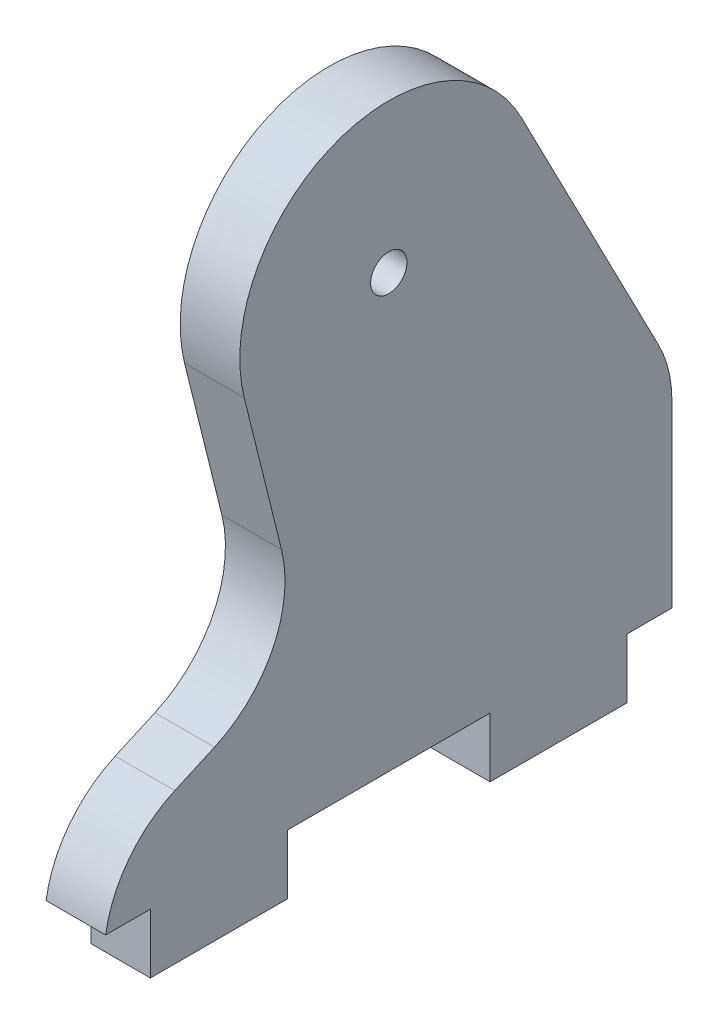
ISO-10303-21;
HEADER;
FILE_DESCRIPTION(('STEP AP214'),'2;1');
FILE_NAME('part.step','',(''),(''),'','','');
FILE_SCHEMA(('AUTOMOTIVE_DESIGN { 1 0 10303 214 1 1 1 1 }'));
ENDSEC;
DATA;
#1=APPLICATION_CONTEXT('core data for automotive mechanical design processes');
#2=APPLICATION_PROTOCOL_DEFINITION('international standard','automotive_design',2000,#1);
#3=PRODUCT_CONTEXT('',#1,'mechanical');
#4=PRODUCT('Part','Part','',(#3));
#5=PRODUCT_RELATED_PRODUCT_CATEGORY('part','',(#4));
#6=PRODUCT_DEFINITION_FORMATION('','',#4);
#7=PRODUCT_DEFINITION_CONTEXT('part definition',#1,'design');
#8=PRODUCT_DEFINITION('design','',#6,#7);
#9=PRODUCT_DEFINITION_SHAPE('','',#8);
#10=(LENGTH_UNIT() NAMED_UNIT(*) SI_UNIT(.MILLI.,.METRE.));
#11=(NAMED_UNIT(*) PLANE_ANGLE_UNIT() SI_UNIT($,.RADIAN.));
#12=(NAMED_UNIT(*) SI_UNIT($,.STERADIAN.) SOLID_ANGLE_UNIT());
#13=UNCERTAINTY_MEASURE_WITH_UNIT(LENGTH_MEASURE(1.E-05),#10,'distance_accuracy_value','');
#14=(GEOMETRIC_REPRESENTATION_CONTEXT(3) GLOBAL_UNCERTAINTY_ASSIGNED_CONTEXT((#13)) GLOBAL_UNIT_ASSIGNED_CONTEXT((#10,
#11,#12)) REPRESENTATION_CONTEXT('',''));
#15=CARTESIAN_POINT('',(0.,0.,0.));
#16=DIRECTION('',(0.,0.,1.));
#17=DIRECTION('',(1.,0.,0.));
#18=AXIS2_PLACEMENT_3D('',#15,#16,#17);
#19=CARTESIAN_POINT('',(2.5,0.,0.));
#20=DIRECTION('',(1.,0.,0.));
#21=DIRECTION('',(0.,0.,-1.));
#22=AXIS2_PLACEMENT_3D('',#19,#20,#21);
#23=PLANE('',#22);
#24=CARTESIAN_POINT('',(2.5,36.23668181,0.));
#25=DIRECTION('',(-1.,0.,0.));
#26=DIRECTION('',(0.,0.,1.));
#27=AXIS2_PLACEMENT_3D('',#24,#25,#26);
#28=CIRCLE('',#27,1.525);
#29=CARTESIAN_POINT('',(2.5,36.23668181,1.525));
#30=VERTEX_POINT('',#29);
#31=EDGE_CURVE('E109',#30,#30,#28,.T.);
#32=ORIENTED_EDGE('',*,*,#31,.T.);
#33=EDGE_LOOP('',(#32));
#34=FACE_BOUND('',#33,.T.);
#35=DIRECTION('',(0.,1.,0.));
#36=VECTOR('',#35,1.);
#37=CARTESIAN_POINT('',(2.5,0.,-20.));
#38=LINE('',#37,#36);
#39=CARTESIAN_POINT('',(2.5,0.,-20.));
#40=VERTEX_POINT('',#39);
#41=CARTESIAN_POINT('',(2.5,-5.,-20.));
#42=VERTEX_POINT('',#41);
#43=EDGE_CURVE('E124',#40,#42,#38,.F.);
#44=ORIENTED_EDGE('',*,*,#43,.F.);
#45=DIRECTION('',(0.,0.,-1.));
#46=VECTOR('',#45,1.);
#47=CARTESIAN_POINT('',(2.5,0.,0.));
#48=LINE('',#47,#46);
#49=CARTESIAN_POINT('',(2.5,0.,-23.75));
#50=VERTEX_POINT('',#49);
#51=EDGE_CURVE('E117',#50,#40,#48,.F.);
#52=ORIENTED_EDGE('',*,*,#51,.F.);
#53=DIRECTION('',(0.,1.,0.));
#54=VECTOR('',#53,1.);
#55=CARTESIAN_POINT('',(2.5,0.,-23.75));
#56=LINE('',#55,#54);
#57=CARTESIAN_POINT('',(2.5,15.0693744428278,-23.75));
#58=VERTEX_POINT('',#57);
#59=EDGE_CURVE('E110',#50,#58,#56,.T.);
#60=ORIENTED_EDGE('',*,*,#59,.T.);
#61=CARTESIAN_POINT('',(2.5,15.0693744428278,-13.75));
#62=DIRECTION('',(-1.,0.,0.));
#63=DIRECTION('',(0.,0.,1.));
#64=AXIS2_PLACEMENT_3D('',#61,#62,#63);
#65=CIRCLE('',#64,10.);
#66=CARTESIAN_POINT('',(2.5,19.6594468083574,-22.6343252799074));
#67=VERTEX_POINT('',#66);
#68=EDGE_CURVE('E113',#67,#58,#65,.T.);
#69=ORIENTED_EDGE('',*,*,#68,.F.);
#70=DIRECTION('',(0.,-0.888432527990742,-0.459007236552955));
#71=VECTOR('',#70,1.);
#72=CARTESIAN_POINT('',(2.5,13.3722115451383,-25.8826152657042));
#73=LINE('',#72,#71);
#74=CARTESIAN_POINT('',(2.5,41.9742722669119,-11.1054065998843));
#75=VERTEX_POINT('',#74);
#76=EDGE_CURVE('E89',#67,#75,#73,.F.);
#77=ORIENTED_EDGE('',*,*,#76,.T.);
#78=CARTESIAN_POINT('',(2.5,36.23668181,0.));
#79=DIRECTION('',(-1.,0.,0.));
#80=DIRECTION('',(0.,0.,1.));
#81=AXIS2_PLACEMENT_3D('',#78,#79,#80);
#82=CIRCLE('',#81,12.5);
#83=CARTESIAN_POINT('',(2.5,33.2203384044635,12.130608907218));
#84=VERTEX_POINT('',#83);
#85=EDGE_CURVE('E19',#84,#75,#82,.T.);
#86=ORIENTED_EDGE('',*,*,#85,.F.);
#87=DIRECTION('',(0.,0.970448712577439,0.241307472442921));
#88=VECTOR('',#87,1.);
#89=CARTESIAN_POINT('',(2.5,-0.90630692505895,3.64482864836073));
#90=LINE('',#89,#88);
#91=CARTESIAN_POINT('',(2.5,20.6225242322865,8.99809231278635));
#92=VERTEX_POINT('',#91);
#93=EDGE_CURVE('E87',#84,#92,#90,.F.);
#94=ORIENTED_EDGE('',*,*,#93,.T.);
#95=CARTESIAN_POINT('',(2.5,18.2094495078573,18.7025794385607));
#96=DIRECTION('',(1.,0.,0.));
#97=DIRECTION('',(0.,0.,-1.));
#98=AXIS2_PLACEMENT_3D('',#95,#96,#97);
#99=CIRCLE('',#98,10.);
#100=CARTESIAN_POINT('',(2.5,9.0798918665335,14.6219940303446));
#101=VERTEX_POINT('',#100);
#102=EDGE_CURVE('E193',#92,#101,#99,.F.);
#103=ORIENTED_EDGE('',*,*,#102,.T.);
#104=DIRECTION('',(0.,0.408058540821615,-0.912955764132378));
#105=VECTOR('',#104,1.);
#106=CARTESIAN_POINT('',(2.5,13.015251813793,5.8173515872475));
#107=LINE('',#106,#105);
#108=CARTESIAN_POINT('',(2.5,7.59266349620767,17.9493933552952));
#109=VERTEX_POINT('',#108);
#110=EDGE_CURVE('E171',#101,#109,#107,.F.);
#111=ORIENTED_EDGE('',*,*,#110,.T.);
#112=CARTESIAN_POINT('',(2.5,-1.53689414511612,13.8688079470791));
#113=DIRECTION('',(-1.,0.,0.));
#114=DIRECTION('',(0.,0.,1.));
#115=AXIS2_PLACEMENT_3D('',#112,#113,#114);
#116=CIRCLE('',#115,10.);
#117=CARTESIAN_POINT('',(2.5,0.,23.75));
#118=VERTEX_POINT('',#117);
#119=EDGE_CURVE('E173',#118,#109,#116,.T.);
#120=ORIENTED_EDGE('',*,*,#119,.F.);
#121=DIRECTION('',(0.,0.,-1.));
#122=VECTOR('',#121,1.);
#123=CARTESIAN_POINT('',(2.5,0.,0.));
#124=LINE('',#123,#122);
#125=CARTESIAN_POINT('',(2.5,0.,20.));
#126=VERTEX_POINT('',#125);
#127=EDGE_CURVE('E165',#126,#118,#124,.F.);
#128=ORIENTED_EDGE('',*,*,#127,.F.);
#129=DIRECTION('',(0.,1.,0.));
#130=VECTOR('',#129,1.);
#131=CARTESIAN_POINT('',(2.5,0.,20.));
#132=LINE('',#131,#130);
#133=CARTESIAN_POINT('',(2.5,-5.,20.));
#134=VERTEX_POINT('',#133);
#135=EDGE_CURVE('E157',#126,#134,#132,.F.);
#136=ORIENTED_EDGE('',*,*,#135,.T.);
#137=DIRECTION('',(0.,0.,-1.));
#138=VECTOR('',#137,1.);
#139=CARTESIAN_POINT('',(2.5,-5.,0.));
#140=LINE('',#139,#138);
#141=CARTESIAN_POINT('',(2.5,-5.,8.5));
#142=VERTEX_POINT('',#141);
#143=EDGE_CURVE('E154',#142,#134,#140,.F.);
#144=ORIENTED_EDGE('',*,*,#143,.F.);
#145=DIRECTION('',(0.,1.,0.));
#146=VECTOR('',#145,1.);
#147=CARTESIAN_POINT('',(2.5,0.,8.5));
#148=LINE('',#147,#146);
#149=CARTESIAN_POINT('',(2.5,0.,8.5));
#150=VERTEX_POINT('',#149);
#151=EDGE_CURVE('E148',#150,#142,#148,.F.);
#152=ORIENTED_EDGE('',*,*,#151,.F.);
#153=DIRECTION('',(0.,0.,-1.));
#154=VECTOR('',#153,1.);
#155=CARTESIAN_POINT('',(2.5,0.,0.));
#156=LINE('',#155,#154);
#157=CARTESIAN_POINT('',(2.5,0.,-8.5));
#158=VERTEX_POINT('',#157);
#159=EDGE_CURVE('E141',#158,#150,#156,.F.);
#160=ORIENTED_EDGE('',*,*,#159,.F.);
#161=DIRECTION('',(0.,1.,0.));
#162=VECTOR('',#161,1.);
#163=CARTESIAN_POINT('',(2.5,0.,-8.5));
#164=LINE('',#163,#162);
#165=CARTESIAN_POINT('',(2.5,-5.,-8.5));
#166=VERTEX_POINT('',#165);
#167=EDGE_CURVE('E135',#158,#166,#164,.F.);
#168=ORIENTED_EDGE('',*,*,#167,.T.);
#169=DIRECTION('',(0.,0.,1.));
#170=VECTOR('',#169,1.);
#171=CARTESIAN_POINT('',(2.5,-5.,0.));
#172=LINE('',#171,#170);
#173=EDGE_CURVE('E127',#166,#42,#172,.F.);
#174=ORIENTED_EDGE('',*,*,#173,.T.);
#175=EDGE_LOOP('',(#44,#52,#60,#69,#77,#86,#94,#103,#111,#120,#128,#136,#144,#152,#160,#168,#174));
#176=FACE_BOUND('',#175,.T.);
#177=ADVANCED_FACE('F16',(#34,#176),#23,.T.);
#178=CARTESIAN_POINT('',(2.5,36.23668181,0.));
#179=DIRECTION('',(-1.,0.,0.));
#180=DIRECTION('',(0.,0.,1.));
#181=AXIS2_PLACEMENT_3D('',#178,#179,#180);
#182=CYLINDRICAL_SURFACE('',#181,12.5);
#183=CARTESIAN_POINT('',(-2.5,36.23668181,0.));
#184=DIRECTION('',(-1.,0.,0.));
#185=DIRECTION('',(0.,0.,1.));
#186=AXIS2_PLACEMENT_3D('',#183,#184,#185);
#187=CIRCLE('',#186,12.5);
#188=CARTESIAN_POINT('',(-2.5,41.9742722669119,-11.1054065998843));
#189=VERTEX_POINT('',#188);
#190=CARTESIAN_POINT('',(-2.5,33.2203384044635,12.130608907218));
#191=VERTEX_POINT('',#190);
#192=EDGE_CURVE('E103',#189,#191,#187,.F.);
#193=ORIENTED_EDGE('',*,*,#192,.T.);
#194=DIRECTION('',(1.,0.,0.));
#195=VECTOR('',#194,1.);
#196=CARTESIAN_POINT('',(2.5,33.2203384044635,12.130608907218));
#197=LINE('',#196,#195);
#198=EDGE_CURVE('E94',#191,#84,#197,.T.);
#199=ORIENTED_EDGE('',*,*,#198,.T.);
#200=ORIENTED_EDGE('',*,*,#85,.T.);
#201=DIRECTION('',(1.,0.,0.));
#202=VECTOR('',#201,1.);
#203=CARTESIAN_POINT('',(2.5,41.9742722669119,-11.1054065998843));
#204=LINE('',#203,#202);
#205=EDGE_CURVE('E278',#75,#189,#204,.F.);
#206=ORIENTED_EDGE('',*,*,#205,.T.);
#207=EDGE_LOOP('',(#193,#199,#200,#206));
#208=FACE_BOUND('',#207,.T.);
#209=ADVANCED_FACE('F102',(#208),#182,.T.);
#210=CARTESIAN_POINT('',(2.5,-0.90630692505895,3.64482864836073));
#211=DIRECTION('',(0.,0.241307472442921,-0.970448712577439));
#212=DIRECTION('',(0.,0.970448712577439,0.241307472442921));
#213=AXIS2_PLACEMENT_3D('',#210,#211,#212);
#214=PLANE('',#213);
#215=DIRECTION('',(1.,0.,0.));
#216=VECTOR('',#215,1.);
#217=CARTESIAN_POINT('',(2.5,20.6225242322865,8.99809231278635));
#218=LINE('',#217,#216);
#219=CARTESIAN_POINT('',(-2.5,20.6225242322865,8.99809231278635));
#220=VERTEX_POINT('',#219);
#221=EDGE_CURVE('E100',#220,#92,#218,.T.);
#222=ORIENTED_EDGE('',*,*,#221,.T.);
#223=ORIENTED_EDGE('',*,*,#93,.F.);
#224=ORIENTED_EDGE('',*,*,#198,.F.);
#225=DIRECTION('',(0.,-0.970448712577439,-0.241307472442921));
#226=VECTOR('',#225,1.);
#227=CARTESIAN_POINT('',(-2.5,33.2203384044635,12.130608907218));
#228=LINE('',#227,#226);
#229=EDGE_CURVE('E187',#191,#220,#228,.T.);
#230=ORIENTED_EDGE('',*,*,#229,.T.);
#231=EDGE_LOOP('',(#222,#223,#224,#230));
#232=FACE_BOUND('',#231,.T.);
#233=ADVANCED_FACE('F97',(#232),#214,.F.);
#234=CARTESIAN_POINT('',(2.5,18.2094495078573,18.7025794385607));
#235=DIRECTION('',(1.,0.,0.));
#236=DIRECTION('',(0.,0.,-1.));
#237=AXIS2_PLACEMENT_3D('',#234,#235,#236);
#238=CYLINDRICAL_SURFACE('',#237,10.);
#239=CARTESIAN_POINT('',(-2.5,18.2094495078573,18.7025794385607));
#240=DIRECTION('',(1.,0.,0.));
#241=DIRECTION('',(0.,0.,-1.));
#242=AXIS2_PLACEMENT_3D('',#239,#240,#241);
#243=CIRCLE('',#242,10.);
#244=CARTESIAN_POINT('',(-2.5,9.0798918665335,14.6219940303446));
#245=VERTEX_POINT('',#244);
#246=EDGE_CURVE('E185',#220,#245,#243,.F.);
#247=ORIENTED_EDGE('',*,*,#246,.T.);
#248=DIRECTION('',(1.,0.,0.));
#249=VECTOR('',#248,1.);
#250=CARTESIAN_POINT('',(2.5,9.0798918665335,14.6219940303446));
#251=LINE('',#250,#249);
#252=EDGE_CURVE('E174',#245,#101,#251,.T.);
#253=ORIENTED_EDGE('',*,*,#252,.T.);
#254=ORIENTED_EDGE('',*,*,#102,.F.);
#255=ORIENTED_EDGE('',*,*,#221,.F.);
#256=EDGE_LOOP('',(#247,#253,#254,#255));
#257=FACE_BOUND('',#256,.T.);
#258=ADVANCED_FACE('F368',(#257),#238,.F.);
#259=CARTESIAN_POINT('',(2.5,13.015251813793,5.8173515872475));
#260=DIRECTION('',(0.,-0.912955764132378,-0.408058540821615));
#261=DIRECTION('',(0.,0.408058540821615,-0.912955764132378));
#262=AXIS2_PLACEMENT_3D('',#259,#260,#261);
#263=PLANE('',#262);
#264=DIRECTION('',(-1.,0.,0.));
#265=VECTOR('',#264,1.);
#266=CARTESIAN_POINT('',(2.5,7.59266349620767,17.9493933552952));
#267=LINE('',#266,#265);
#268=CARTESIAN_POINT('',(-2.5,7.59266349620767,17.9493933552952));
#269=VERTEX_POINT('',#268);
#270=EDGE_CURVE('E168',#109,#269,#267,.T.);
#271=ORIENTED_EDGE('',*,*,#270,.F.);
#272=ORIENTED_EDGE('',*,*,#110,.F.);
#273=ORIENTED_EDGE('',*,*,#252,.F.);
#274=DIRECTION('',(0.,-0.408058540821615,0.912955764132378));
#275=VECTOR('',#274,1.);
#276=CARTESIAN_POINT('',(-2.5,9.0798918665335,14.6219940303446));
#277=LINE('',#276,#275);
#278=EDGE_CURVE('E184',#245,#269,#277,.T.);
#279=ORIENTED_EDGE('',*,*,#278,.T.);
#280=EDGE_LOOP('',(#271,#272,#273,#279));
#281=FACE_BOUND('',#280,.T.);
#282=ADVANCED_FACE('F366',(#281),#263,.F.);
#283=CARTESIAN_POINT('',(2.5,-1.53689414511612,13.8688079470791));
#284=DIRECTION('',(-1.,0.,0.));
#285=DIRECTION('',(0.,0.,1.));
#286=AXIS2_PLACEMENT_3D('',#283,#284,#285);
#287=CYLINDRICAL_SURFACE('',#286,10.);
#288=CARTESIAN_POINT('',(-2.5,-1.53689414511612,13.8688079470791));
#289=DIRECTION('',(-1.,0.,0.));
#290=DIRECTION('',(0.,0.,1.));
#291=AXIS2_PLACEMENT_3D('',#288,#289,#290);
#292=CIRCLE('',#291,10.);
#293=CARTESIAN_POINT('',(-2.5,0.,23.75));
#294=VERTEX_POINT('',#293);
#295=EDGE_CURVE('E180',#269,#294,#292,.F.);
#296=ORIENTED_EDGE('',*,*,#295,.T.);
#297=DIRECTION('',(1.,0.,0.));
#298=VECTOR('',#297,1.);
#299=CARTESIAN_POINT('',(2.5,0.,23.75));
#300=LINE('',#299,#298);
#301=EDGE_CURVE('E167',#118,#294,#300,.F.);
#302=ORIENTED_EDGE('',*,*,#301,.F.);
#303=ORIENTED_EDGE('',*,*,#119,.T.);
#304=ORIENTED_EDGE('',*,*,#270,.T.);
#305=EDGE_LOOP('',(#296,#302,#303,#304));
#306=FACE_BOUND('',#305,.T.);
#307=ADVANCED_FACE('F363',(#306),#287,.T.);
#308=CARTESIAN_POINT('',(2.5,0.,0.));
#309=DIRECTION('',(0.,-1.,0.));
#310=DIRECTION('',(0.,0.,-1.));
#311=AXIS2_PLACEMENT_3D('',#308,#309,#310);
#312=PLANE('',#311);
#313=ORIENTED_EDGE('',*,*,#127,.T.);
#314=ORIENTED_EDGE('',*,*,#301,.T.);
#315=DIRECTION('',(0.,0.,-1.));
#316=VECTOR('',#315,1.);
#317=CARTESIAN_POINT('',(-2.5,0.,0.));
#318=LINE('',#317,#316);
#319=CARTESIAN_POINT('',(-2.5,0.,20.));
#320=VERTEX_POINT('',#319);
#321=EDGE_CURVE('E183',#294,#320,#318,.T.);
#322=ORIENTED_EDGE('',*,*,#321,.T.);
#323=DIRECTION('',(-1.,0.,0.));
#324=VECTOR('',#323,1.);
#325=CARTESIAN_POINT('',(2.5,0.,20.));
#326=LINE('',#325,#324);
#327=EDGE_CURVE('E162',#320,#126,#326,.F.);
#328=ORIENTED_EDGE('',*,*,#327,.T.);
#329=EDGE_LOOP('',(#313,#314,#322,#328));
#330=FACE_BOUND('',#329,.T.);
#331=ADVANCED_FACE('F357',(#330),#312,.T.);
#332=CARTESIAN_POINT('',(2.5,0.,20.));
#333=DIRECTION('',(0.,0.,-1.));
#334=DIRECTION('',(-1.,0.,0.));
#335=AXIS2_PLACEMENT_3D('',#332,#333,#334);
#336=PLANE('',#335);
#337=DIRECTION('',(1.,0.,0.));
#338=VECTOR('',#337,1.);
#339=CARTESIAN_POINT('',(2.5,-5.,20.));
#340=LINE('',#339,#338);
#341=CARTESIAN_POINT('',(-2.5,-5.,20.));
#342=VERTEX_POINT('',#341);
#343=EDGE_CURVE('E151',#134,#342,#340,.F.);
#344=ORIENTED_EDGE('',*,*,#343,.F.);
#345=ORIENTED_EDGE('',*,*,#135,.F.);
#346=ORIENTED_EDGE('',*,*,#327,.F.);
#347=DIRECTION('',(0.,1.,0.));
#348=VECTOR('',#347,1.);
#349=CARTESIAN_POINT('',(-2.5,0.,20.));
#350=LINE('',#349,#348);
#351=EDGE_CURVE('E207',#320,#342,#350,.F.);
#352=ORIENTED_EDGE('',*,*,#351,.T.);
#353=EDGE_LOOP('',(#344,#345,#346,#352));
#354=FACE_BOUND('',#353,.T.);
#355=ADVANCED_FACE('F355',(#354),#336,.F.);
#356=CARTESIAN_POINT('',(2.5,-5.,0.));
#357=DIRECTION('',(0.,-1.,0.));
#358=DIRECTION('',(0.,0.,-1.));
#359=AXIS2_PLACEMENT_3D('',#356,#357,#358);
#360=PLANE('',#359);
#361=ORIENTED_EDGE('',*,*,#143,.T.);
#362=ORIENTED_EDGE('',*,*,#343,.T.);
#363=DIRECTION('',(0.,0.,-1.));
#364=VECTOR('',#363,1.);
#365=CARTESIAN_POINT('',(-2.5,-5.,0.));
#366=LINE('',#365,#364);
#367=CARTESIAN_POINT('',(-2.5,-5.,8.5));
#368=VERTEX_POINT('',#367);
#369=EDGE_CURVE('E210',#342,#368,#366,.T.);
#370=ORIENTED_EDGE('',*,*,#369,.T.);
#371=DIRECTION('',(-1.,0.,0.));
#372=VECTOR('',#371,1.);
#373=CARTESIAN_POINT('',(2.5,-5.,8.5));
#374=LINE('',#373,#372);
#375=EDGE_CURVE('E145',#142,#368,#374,.T.);
#376=ORIENTED_EDGE('',*,*,#375,.F.);
#377=EDGE_LOOP('',(#361,#362,#370,#376));
#378=FACE_BOUND('',#377,.T.);
#379=ADVANCED_FACE('F414',(#378),#360,.T.);
#380=CARTESIAN_POINT('',(2.5,0.,8.5));
#381=DIRECTION('',(0.,0.,-1.));
#382=DIRECTION('',(-1.,0.,0.));
#383=AXIS2_PLACEMENT_3D('',#380,#381,#382);
#384=PLANE('',#383);
#385=ORIENTED_EDGE('',*,*,#151,.T.);
#386=ORIENTED_EDGE('',*,*,#375,.T.);
#387=DIRECTION('',(0.,1.,0.));
#388=VECTOR('',#387,1.);
#389=CARTESIAN_POINT('',(-2.5,0.,8.5));
#390=LINE('',#389,#388);
#391=CARTESIAN_POINT('',(-2.5,0.,8.5));
#392=VERTEX_POINT('',#391);
#393=EDGE_CURVE('E219',#368,#392,#390,.T.);
#394=ORIENTED_EDGE('',*,*,#393,.T.);
#395=DIRECTION('',(1.,0.,0.));
#396=VECTOR('',#395,1.);
#397=CARTESIAN_POINT('',(2.5,0.,8.5));
#398=LINE('',#397,#396);
#399=EDGE_CURVE('E144',#150,#392,#398,.F.);
#400=ORIENTED_EDGE('',*,*,#399,.F.);
#401=EDGE_LOOP('',(#385,#386,#394,#400));
#402=FACE_BOUND('',#401,.T.);
#403=ADVANCED_FACE('F410',(#402),#384,.T.);
#404=CARTESIAN_POINT('',(2.5,0.,0.));
#405=DIRECTION('',(0.,-1.,0.));
#406=DIRECTION('',(0.,0.,-1.));
#407=AXIS2_PLACEMENT_3D('',#404,#405,#406);
#408=PLANE('',#407);
#409=ORIENTED_EDGE('',*,*,#159,.T.);
#410=ORIENTED_EDGE('',*,*,#399,.T.);
#411=DIRECTION('',(0.,0.,-1.));
#412=VECTOR('',#411,1.);
#413=CARTESIAN_POINT('',(-2.5,0.,0.));
#414=LINE('',#413,#412);
#415=CARTESIAN_POINT('',(-2.5,0.,-8.5));
#416=VERTEX_POINT('',#415);
#417=EDGE_CURVE('E228',#392,#416,#414,.T.);
#418=ORIENTED_EDGE('',*,*,#417,.T.);
#419=DIRECTION('',(-1.,0.,0.));
#420=VECTOR('',#419,1.);
#421=CARTESIAN_POINT('',(2.5,0.,-8.5));
#422=LINE('',#421,#420);
#423=EDGE_CURVE('E138',#416,#158,#422,.F.);
#424=ORIENTED_EDGE('',*,*,#423,.T.);
#425=EDGE_LOOP('',(#409,#410,#418,#424));
#426=FACE_BOUND('',#425,.T.);
#427=ADVANCED_FACE('F406',(#426),#408,.T.);
#428=CARTESIAN_POINT('',(2.5,0.,-8.5));
#429=DIRECTION('',(0.,0.,-1.));
#430=DIRECTION('',(-1.,0.,0.));
#431=AXIS2_PLACEMENT_3D('',#428,#429,#430);
#432=PLANE('',#431);
#433=DIRECTION('',(1.,0.,0.));
#434=VECTOR('',#433,1.);
#435=CARTESIAN_POINT('',(2.5,-5.,-8.5));
#436=LINE('',#435,#434);
#437=CARTESIAN_POINT('',(-2.5,-5.,-8.5));
#438=VERTEX_POINT('',#437);
#439=EDGE_CURVE('E132',#438,#166,#436,.T.);
#440=ORIENTED_EDGE('',*,*,#439,.T.);
#441=ORIENTED_EDGE('',*,*,#167,.F.);
#442=ORIENTED_EDGE('',*,*,#423,.F.);
#443=DIRECTION('',(0.,1.,0.));
#444=VECTOR('',#443,1.);
#445=CARTESIAN_POINT('',(-2.5,0.,-8.5));
#446=LINE('',#445,#444);
#447=EDGE_CURVE('E237',#416,#438,#446,.F.);
#448=ORIENTED_EDGE('',*,*,#447,.T.);
#449=EDGE_LOOP('',(#440,#441,#442,#448));
#450=FACE_BOUND('',#449,.T.);
#451=ADVANCED_FACE('F402',(#450),#432,.F.);
#452=CARTESIAN_POINT('',(2.5,-5.,0.));
#453=DIRECTION('',(0.,1.,0.));
#454=DIRECTION('',(0.,0.,1.));
#455=AXIS2_PLACEMENT_3D('',#452,#453,#454);
#456=PLANE('',#455);
#457=DIRECTION('',(-1.,0.,0.));
#458=VECTOR('',#457,1.);
#459=CARTESIAN_POINT('',(2.5,-5.,-20.));
#460=LINE('',#459,#458);
#461=CARTESIAN_POINT('',(-2.5,-5.,-20.));
#462=VERTEX_POINT('',#461);
#463=EDGE_CURVE('E121',#42,#462,#460,.T.);
#464=ORIENTED_EDGE('',*,*,#463,.F.);
#465=ORIENTED_EDGE('',*,*,#173,.F.);
#466=ORIENTED_EDGE('',*,*,#439,.F.);
#467=DIRECTION('',(0.,0.,-1.));
#468=VECTOR('',#467,1.);
#469=CARTESIAN_POINT('',(-2.5,-5.,0.));
#470=LINE('',#469,#468);
#471=EDGE_CURVE('E246',#438,#462,#470,.T.);
#472=ORIENTED_EDGE('',*,*,#471,.T.);
#473=EDGE_LOOP('',(#464,#465,#466,#472));
#474=FACE_BOUND('',#473,.T.);
#475=ADVANCED_FACE('F399',(#474),#456,.F.);
#476=CARTESIAN_POINT('',(2.5,0.,-20.));
#477=DIRECTION('',(0.,0.,-1.));
#478=DIRECTION('',(-1.,0.,0.));
#479=AXIS2_PLACEMENT_3D('',#476,#477,#478);
#480=PLANE('',#479);
#481=ORIENTED_EDGE('',*,*,#43,.T.);
#482=ORIENTED_EDGE('',*,*,#463,.T.);
#483=DIRECTION('',(0.,1.,0.));
#484=VECTOR('',#483,1.);
#485=CARTESIAN_POINT('',(-2.5,0.,-20.));
#486=LINE('',#485,#484);
#487=CARTESIAN_POINT('',(-2.5,0.,-20.));
#488=VERTEX_POINT('',#487);
#489=EDGE_CURVE('E255',#462,#488,#486,.T.);
#490=ORIENTED_EDGE('',*,*,#489,.T.);
#491=DIRECTION('',(1.,0.,0.));
#492=VECTOR('',#491,1.);
#493=CARTESIAN_POINT('',(2.5,0.,-20.));
#494=LINE('',#493,#492);
#495=EDGE_CURVE('E120',#40,#488,#494,.F.);
#496=ORIENTED_EDGE('',*,*,#495,.F.);
#497=EDGE_LOOP('',(#481,#482,#490,#496));
#498=FACE_BOUND('',#497,.T.);
#499=ADVANCED_FACE('F316',(#498),#480,.T.);
#500=CARTESIAN_POINT('',(2.5,0.,0.));
#501=DIRECTION('',(0.,-1.,0.));
#502=DIRECTION('',(0.,0.,-1.));
#503=AXIS2_PLACEMENT_3D('',#500,#501,#502);
#504=PLANE('',#503);
#505=ORIENTED_EDGE('',*,*,#51,.T.);
#506=ORIENTED_EDGE('',*,*,#495,.T.);
#507=DIRECTION('',(0.,0.,-1.));
#508=VECTOR('',#507,1.);
#509=CARTESIAN_POINT('',(-2.5,0.,0.));
#510=LINE('',#509,#508);
#511=CARTESIAN_POINT('',(-2.5,0.,-23.75));
#512=VERTEX_POINT('',#511);
#513=EDGE_CURVE('E264',#488,#512,#510,.T.);
#514=ORIENTED_EDGE('',*,*,#513,.T.);
#515=DIRECTION('',(1.,0.,0.));
#516=VECTOR('',#515,1.);
#517=CARTESIAN_POINT('',(2.5,0.,-23.75));
#518=LINE('',#517,#516);
#519=EDGE_CURVE('E114',#512,#50,#518,.T.);
#520=ORIENTED_EDGE('',*,*,#519,.T.);
#521=EDGE_LOOP('',(#505,#506,#514,#520));
#522=FACE_BOUND('',#521,.T.);
#523=ADVANCED_FACE('F309',(#522),#504,.T.);
#524=CARTESIAN_POINT('',(2.5,0.,-23.75));
#525=DIRECTION('',(0.,0.,1.));
#526=DIRECTION('',(1.,0.,0.));
#527=AXIS2_PLACEMENT_3D('',#524,#525,#526);
#528=PLANE('',#527);
#529=DIRECTION('',(-1.,0.,0.));
#530=VECTOR('',#529,1.);
#531=CARTESIAN_POINT('',(2.5,15.0693744428278,-23.75));
#532=LINE('',#531,#530);
#533=CARTESIAN_POINT('',(-2.5,15.0693744428278,-23.75));
#534=VERTEX_POINT('',#533);
#535=EDGE_CURVE('E192',#58,#534,#532,.T.);
#536=ORIENTED_EDGE('',*,*,#535,.F.);
#537=ORIENTED_EDGE('',*,*,#59,.F.);
#538=ORIENTED_EDGE('',*,*,#519,.F.);
#539=DIRECTION('',(0.,1.,0.));
#540=VECTOR('',#539,1.);
#541=CARTESIAN_POINT('',(-2.5,0.,-23.75));
#542=LINE('',#541,#540);
#543=EDGE_CURVE('E179',#512,#534,#542,.T.);
#544=ORIENTED_EDGE('',*,*,#543,.T.);
#545=EDGE_LOOP('',(#536,#537,#538,#544));
#546=FACE_BOUND('',#545,.T.);
#547=ADVANCED_FACE('F302',(#546),#528,.F.);
#548=CARTESIAN_POINT('',(2.5,15.0693744428278,-13.75));
#549=DIRECTION('',(-1.,0.,0.));
#550=DIRECTION('',(0.,0.,1.));
#551=AXIS2_PLACEMENT_3D('',#548,#549,#550);
#552=CYLINDRICAL_SURFACE('',#551,10.);
#553=CARTESIAN_POINT('',(-2.5,15.0693744428278,-13.75));
#554=DIRECTION('',(-1.,0.,0.));
#555=DIRECTION('',(0.,0.,1.));
#556=AXIS2_PLACEMENT_3D('',#553,#554,#555);
#557=CIRCLE('',#556,10.);
#558=CARTESIAN_POINT('',(-2.5,19.6594468083574,-22.6343252799074));
#559=VERTEX_POINT('',#558);
#560=EDGE_CURVE('E176',#534,#559,#557,.F.);
#561=ORIENTED_EDGE('',*,*,#560,.T.);
#562=DIRECTION('',(1.,0.,0.));
#563=VECTOR('',#562,1.);
#564=CARTESIAN_POINT('',(2.5,19.6594468083574,-22.6343252799074));
#565=LINE('',#564,#563);
#566=EDGE_CURVE('E34',#559,#67,#565,.T.);
#567=ORIENTED_EDGE('',*,*,#566,.T.);
#568=ORIENTED_EDGE('',*,*,#68,.T.);
#569=ORIENTED_EDGE('',*,*,#535,.T.);
#570=EDGE_LOOP('',(#561,#567,#568,#569));
#571=FACE_BOUND('',#570,.T.);
#572=ADVANCED_FACE('F298',(#571),#552,.T.);
#573=CARTESIAN_POINT('',(2.5,13.3722115451383,-25.8826152657042));
#574=DIRECTION('',(0.,-0.459007236552955,0.888432527990742));
#575=DIRECTION('',(0.,-0.888432527990742,-0.459007236552955));
#576=AXIS2_PLACEMENT_3D('',#573,#574,#575);
#577=PLANE('',#576);
#578=ORIENTED_EDGE('',*,*,#566,.F.);
#579=DIRECTION('',(0.,0.888432527990742,0.459007236552955));
#580=VECTOR('',#579,1.);
#581=CARTESIAN_POINT('',(-2.5,19.6594468083574,-22.6343252799074));
#582=LINE('',#581,#580);
#583=EDGE_CURVE('E25',#559,#189,#582,.T.);
#584=ORIENTED_EDGE('',*,*,#583,.T.);
#585=ORIENTED_EDGE('',*,*,#205,.F.);
#586=ORIENTED_EDGE('',*,*,#76,.F.);
#587=EDGE_LOOP('',(#578,#584,#585,#586));
#588=FACE_BOUND('',#587,.T.);
#589=ADVANCED_FACE('F292',(#588),#577,.F.);
#590=CARTESIAN_POINT('',(2.5,36.23668181,0.));
#591=DIRECTION('',(-1.,0.,0.));
#592=DIRECTION('',(0.,0.,1.));
#593=AXIS2_PLACEMENT_3D('',#590,#591,#592);
#594=CYLINDRICAL_SURFACE('',#593,1.525);
#595=CARTESIAN_POINT('',(-2.5,36.23668181,0.));
#596=DIRECTION('',(-1.,0.,0.));
#597=DIRECTION('',(0.,0.,1.));
#598=AXIS2_PLACEMENT_3D('',#595,#596,#597);
#599=CIRCLE('',#598,1.525);
#600=CARTESIAN_POINT('',(-2.5,36.23668181,1.525));
#601=VERTEX_POINT('',#600);
#602=EDGE_CURVE('E11',#601,#601,#599,.T.);
#603=ORIENTED_EDGE('',*,*,#602,.T.);
#604=EDGE_LOOP('',(#603));
#605=FACE_BOUND('',#604,.T.);
#606=ORIENTED_EDGE('',*,*,#31,.F.);
#607=EDGE_LOOP('',(#606));
#608=FACE_BOUND('',#607,.T.);
#609=ADVANCED_FACE('F379',(#605,#608),#594,.F.);
#610=CARTESIAN_POINT('',(-2.5,0.,0.));
#611=DIRECTION('',(1.,0.,0.));
#612=DIRECTION('',(0.,0.,-1.));
#613=AXIS2_PLACEMENT_3D('',#610,#611,#612);
#614=PLANE('',#613);
#615=ORIENTED_EDGE('',*,*,#602,.F.);
#616=EDGE_LOOP('',(#615));
#617=FACE_BOUND('',#616,.T.);
#618=ORIENTED_EDGE('',*,*,#560,.F.);
#619=ORIENTED_EDGE('',*,*,#543,.F.);
#620=ORIENTED_EDGE('',*,*,#513,.F.);
#621=ORIENTED_EDGE('',*,*,#489,.F.);
#622=ORIENTED_EDGE('',*,*,#471,.F.);
#623=ORIENTED_EDGE('',*,*,#447,.F.);
#624=ORIENTED_EDGE('',*,*,#417,.F.);
#625=ORIENTED_EDGE('',*,*,#393,.F.);
#626=ORIENTED_EDGE('',*,*,#369,.F.);
#627=ORIENTED_EDGE('',*,*,#351,.F.);
#628=ORIENTED_EDGE('',*,*,#321,.F.);
#629=ORIENTED_EDGE('',*,*,#295,.F.);
#630=ORIENTED_EDGE('',*,*,#278,.F.);
#631=ORIENTED_EDGE('',*,*,#246,.F.);
#632=ORIENTED_EDGE('',*,*,#229,.F.);
#633=ORIENTED_EDGE('',*,*,#192,.F.);
#634=ORIENTED_EDGE('',*,*,#583,.F.);
#635=EDGE_LOOP('',(#618,#619,#620,#621,#622,#623,#624,#625,#626,#627,#628,#629,#630,#631,#632,
#633,#634));
#636=FACE_BOUND('',#635,.T.);
#637=ADVANCED_FACE('F295',(#617,#636),#614,.F.);
#638=CLOSED_SHELL('',(#177,#209,#233,#258,#282,#307,#331,#355,#379,#403,#427,#451,#475,#499,
#523,#547,#572,#589,#609,#637));
#639=MANIFOLD_SOLID_BREP('B1',#638);
#640=ADVANCED_BREP_SHAPE_REPRESENTATION('',(#18,#639),#14);
#641=SHAPE_DEFINITION_REPRESENTATION(#9,#640);
ENDSEC;
END-ISO-10303-21;
